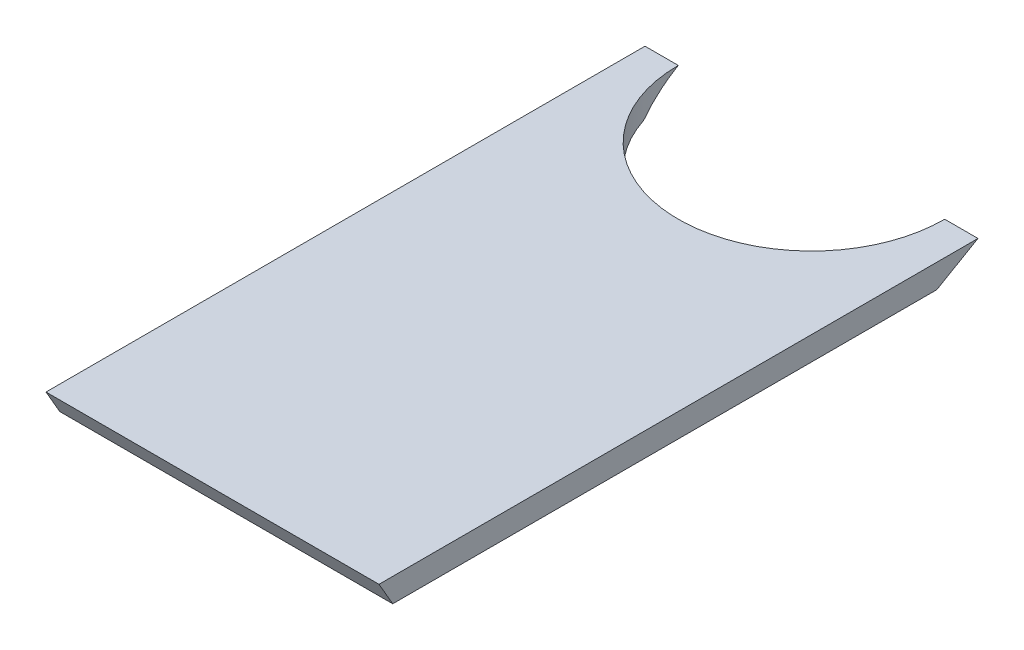
ISO-10303-21;
HEADER;
FILE_DESCRIPTION(('STEP AP214'),'2;1');
FILE_NAME('part.step','',(''),(''),'','','');
FILE_SCHEMA(('AUTOMOTIVE_DESIGN { 1 0 10303 214 1 1 1 1 }'));
ENDSEC;
DATA;
#1=APPLICATION_CONTEXT('core data for automotive mechanical design processes');
#2=APPLICATION_PROTOCOL_DEFINITION('international standard','automotive_design',2000,#1);
#3=PRODUCT_CONTEXT('',#1,'mechanical');
#4=PRODUCT('Part','Part','',(#3));
#5=PRODUCT_RELATED_PRODUCT_CATEGORY('part','',(#4));
#6=PRODUCT_DEFINITION_FORMATION('','',#4);
#7=PRODUCT_DEFINITION_CONTEXT('part definition',#1,'design');
#8=PRODUCT_DEFINITION('design','',#6,#7);
#9=PRODUCT_DEFINITION_SHAPE('','',#8);
#10=(LENGTH_UNIT() NAMED_UNIT(*) SI_UNIT(.MILLI.,.METRE.));
#11=(NAMED_UNIT(*) PLANE_ANGLE_UNIT() SI_UNIT($,.RADIAN.));
#12=(NAMED_UNIT(*) SI_UNIT($,.STERADIAN.) SOLID_ANGLE_UNIT());
#13=UNCERTAINTY_MEASURE_WITH_UNIT(LENGTH_MEASURE(1.E-05),#10,'distance_accuracy_value','');
#14=(GEOMETRIC_REPRESENTATION_CONTEXT(3) GLOBAL_UNCERTAINTY_ASSIGNED_CONTEXT((#13)) GLOBAL_UNIT_ASSIGNED_CONTEXT((#10,
#11,#12)) REPRESENTATION_CONTEXT('',''));
#15=CARTESIAN_POINT('',(0.,0.,0.));
#16=DIRECTION('',(0.,0.,1.));
#17=DIRECTION('',(1.,0.,0.));
#18=AXIS2_PLACEMENT_3D('',#15,#16,#17);
#19=CARTESIAN_POINT('',(44.45,-28.3981155746347,-16.395659671494));
#20=DIRECTION('',(0.,-0.866025403784432,-0.500000000000012));
#21=DIRECTION('',(0.,0.500000000000012,-0.866025403784432));
#22=AXIS2_PLACEMENT_3D('',#19,#20,#21);
#23=PLANE('',#22);
#24=DIRECTION('',(-1.,0.,0.));
#25=VECTOR('',#24,1.);
#26=CARTESIAN_POINT('',(44.45,3.17499999999927,-71.0819000000025));
#27=LINE('',#26,#25);
#28=CARTESIAN_POINT('',(-35.56,3.17499999999927,-71.0819000000025));
#29=VERTEX_POINT('',#28);
#30=CARTESIAN_POINT('',(-44.45,3.17499999999927,-71.0819000000025));
#31=VERTEX_POINT('',#30);
#32=EDGE_CURVE('E108',#29,#31,#27,.T.);
#33=ORIENTED_EDGE('',*,*,#32,.F.);
#34=CARTESIAN_POINT('',(0.,3.17499999999927,-71.0819000000025));
#35=DIRECTION('',(0.,-0.866025403784432,-0.500000000000012));
#36=DIRECTION('',(0.,0.500000000000012,-0.866025403784432));
#37=AXIS2_PLACEMENT_3D('',#34,#35,#36);
#38=ELLIPSE('',#37,41.0611511447665,35.56);
#39=CARTESIAN_POINT('',(-33.8163584674641,-3.17500000000075,-60.0833773719417));
#40=VERTEX_POINT('',#39);
#41=EDGE_CURVE('E96',#29,#40,#38,.F.);
#42=ORIENTED_EDGE('',*,*,#41,.T.);
#43=DIRECTION('',(-1.,0.,0.));
#44=VECTOR('',#43,1.);
#45=CARTESIAN_POINT('',(44.45,-3.17500000000003,-60.0833773719417));
#46=LINE('',#45,#44);
#47=CARTESIAN_POINT('',(-44.45,-3.17500000000003,-60.0833773719417));
#48=VERTEX_POINT('',#47);
#49=EDGE_CURVE('E79',#40,#48,#46,.T.);
#50=ORIENTED_EDGE('',*,*,#49,.T.);
#51=DIRECTION('',(0.,-0.500000000000012,0.866025403784432));
#52=VECTOR('',#51,1.);
#53=CARTESIAN_POINT('',(-44.45,-28.3981155746347,-16.395659671494));
#54=LINE('',#53,#52);
#55=EDGE_CURVE('E124',#31,#48,#54,.T.);
#56=ORIENTED_EDGE('',*,*,#55,.F.);
#57=EDGE_LOOP('',(#33,#42,#50,#56));
#58=FACE_BOUND('',#57,.T.);
#59=ADVANCED_FACE('F35',(#58),#23,.T.);
#60=CARTESIAN_POINT('',(44.45,-3.17500000000003,-60.0833773719417));
#61=VERTEX_POINT('',#60);
#62=CARTESIAN_POINT('',(33.8163584674641,-3.17500000000003,-60.0833773719417));
#63=VERTEX_POINT('',#62);
#64=EDGE_CURVE('E102',#61,#63,#46,.T.);
#65=ORIENTED_EDGE('',*,*,#64,.T.);
#66=CARTESIAN_POINT('',(35.56,3.17499999999927,-71.0819000000025));
#67=VERTEX_POINT('',#66);
#68=EDGE_CURVE('E48',#63,#67,#38,.F.);
#69=ORIENTED_EDGE('',*,*,#68,.T.);
#70=CARTESIAN_POINT('',(44.45,3.17499999999927,-71.0819000000025));
#71=VERTEX_POINT('',#70);
#72=EDGE_CURVE('E42',#71,#67,#27,.T.);
#73=ORIENTED_EDGE('',*,*,#72,.F.);
#74=DIRECTION('',(0.,-0.500000000000012,0.866025403784432));
#75=VECTOR('',#74,1.);
#76=CARTESIAN_POINT('',(44.45,-28.3981155746347,-16.395659671494));
#77=LINE('',#76,#75);
#78=EDGE_CURVE('E118',#71,#61,#77,.T.);
#79=ORIENTED_EDGE('',*,*,#78,.T.);
#80=EDGE_LOOP('',(#65,#69,#73,#79));
#81=FACE_BOUND('',#80,.T.);
#82=ADVANCED_FACE('F101',(#81),#23,.T.);
#83=CARTESIAN_POINT('',(44.45,3.17499999999927,0.));
#84=DIRECTION('',(0.,1.,0.));
#85=DIRECTION('',(0.,0.,1.));
#86=AXIS2_PLACEMENT_3D('',#83,#84,#85);
#87=PLANE('',#86);
#88=ORIENTED_EDGE('',*,*,#72,.T.);
#89=CARTESIAN_POINT('',(0.,3.17499999999927,-71.0819000000025));
#90=DIRECTION('',(0.,1.,0.));
#91=DIRECTION('',(0.,0.,1.));
#92=AXIS2_PLACEMENT_3D('',#89,#90,#91);
#93=CIRCLE('',#92,35.56);
#94=EDGE_CURVE('E94',#67,#29,#93,.F.);
#95=ORIENTED_EDGE('',*,*,#94,.T.);
#96=ORIENTED_EDGE('',*,*,#32,.T.);
#97=DIRECTION('',(0.,0.,-1.));
#98=VECTOR('',#97,1.);
#99=CARTESIAN_POINT('',(-44.45,3.17499999999927,0.));
#100=LINE('',#99,#98);
#101=CARTESIAN_POINT('',(-44.45,3.17499999999927,88.8254705950004));
#102=VERTEX_POINT('',#101);
#103=EDGE_CURVE('E121',#102,#31,#100,.T.);
#104=ORIENTED_EDGE('',*,*,#103,.F.);
#105=DIRECTION('',(-1.,0.,0.));
#106=VECTOR('',#105,1.);
#107=CARTESIAN_POINT('',(44.45,3.17499999999927,88.8254705950004));
#108=LINE('',#107,#106);
#109=CARTESIAN_POINT('',(44.45,3.17499999999927,88.8254705950004));
#110=VERTEX_POINT('',#109);
#111=EDGE_CURVE('E109',#110,#102,#108,.T.);
#112=ORIENTED_EDGE('',*,*,#111,.F.);
#113=DIRECTION('',(0.,0.,-1.));
#114=VECTOR('',#113,1.);
#115=CARTESIAN_POINT('',(44.45,3.17499999999927,0.));
#116=LINE('',#115,#114);
#117=EDGE_CURVE('E107',#110,#71,#116,.T.);
#118=ORIENTED_EDGE('',*,*,#117,.T.);
#119=EDGE_LOOP('',(#88,#95,#96,#104,#112,#118));
#120=FACE_BOUND('',#119,.T.);
#121=ADVANCED_FACE('F105',(#120),#87,.T.);
#122=CARTESIAN_POINT('',(44.45,-3.17500000000033,0.));
#123=DIRECTION('',(0.,1.,0.));
#124=DIRECTION('',(0.,0.,1.));
#125=AXIS2_PLACEMENT_3D('',#122,#123,#124);
#126=PLANE('',#125);
#127=CARTESIAN_POINT('',(0.,-3.17499999999997,-71.0819000000025));
#128=DIRECTION('',(0.,1.,0.));
#129=DIRECTION('',(0.,0.,1.));
#130=AXIS2_PLACEMENT_3D('',#127,#128,#129);
#131=CIRCLE('',#130,35.56);
#132=EDGE_CURVE('E11',#63,#40,#131,.F.);
#133=ORIENTED_EDGE('',*,*,#132,.F.);
#134=ORIENTED_EDGE('',*,*,#64,.F.);
#135=DIRECTION('',(0.,0.,-1.));
#136=VECTOR('',#135,1.);
#137=CARTESIAN_POINT('',(44.45,-3.17500000000033,0.));
#138=LINE('',#137,#136);
#139=CARTESIAN_POINT('',(44.45,-3.17500000000075,85.1592963856463));
#140=VERTEX_POINT('',#139);
#141=EDGE_CURVE('E57',#140,#61,#138,.T.);
#142=ORIENTED_EDGE('',*,*,#141,.F.);
#143=DIRECTION('',(-1.,0.,0.));
#144=VECTOR('',#143,1.);
#145=CARTESIAN_POINT('',(44.45,-3.17500000000075,85.1592963856463));
#146=LINE('',#145,#144);
#147=CARTESIAN_POINT('',(-44.45,-3.17500000000075,85.1592963856463));
#148=VERTEX_POINT('',#147);
#149=EDGE_CURVE('E112',#140,#148,#146,.T.);
#150=ORIENTED_EDGE('',*,*,#149,.T.);
#151=DIRECTION('',(0.,0.,-1.));
#152=VECTOR('',#151,1.);
#153=CARTESIAN_POINT('',(-44.45,-3.17500000000033,0.));
#154=LINE('',#153,#152);
#155=EDGE_CURVE('E116',#148,#48,#154,.T.);
#156=ORIENTED_EDGE('',*,*,#155,.T.);
#157=ORIENTED_EDGE('',*,*,#49,.F.);
#158=EDGE_LOOP('',(#133,#134,#142,#150,#156,#157));
#159=FACE_BOUND('',#158,.T.);
#160=ADVANCED_FACE('F139',(#159),#126,.F.);
#161=CARTESIAN_POINT('',(44.45,-37.6688070191892,65.2442876177428));
#162=DIRECTION('',(0.,0.5,-0.866025403784438));
#163=DIRECTION('',(0.,0.866025403784439,0.5));
#164=AXIS2_PLACEMENT_3D('',#161,#162,#163);
#165=PLANE('',#164);
#166=DIRECTION('',(0.,-0.866025403784438,-0.5));
#167=VECTOR('',#166,1.);
#168=CARTESIAN_POINT('',(-44.45,-37.6688070191892,65.2442876177428));
#169=LINE('',#168,#167);
#170=EDGE_CURVE('E119',#102,#148,#169,.T.);
#171=ORIENTED_EDGE('',*,*,#170,.T.);
#172=ORIENTED_EDGE('',*,*,#149,.F.);
#173=DIRECTION('',(0.,-0.866025403784438,-0.5));
#174=VECTOR('',#173,1.);
#175=CARTESIAN_POINT('',(44.45,-37.6688070191892,65.2442876177428));
#176=LINE('',#175,#174);
#177=EDGE_CURVE('E128',#110,#140,#176,.T.);
#178=ORIENTED_EDGE('',*,*,#177,.F.);
#179=ORIENTED_EDGE('',*,*,#111,.T.);
#180=EDGE_LOOP('',(#171,#172,#178,#179));
#181=FACE_BOUND('',#180,.T.);
#182=ADVANCED_FACE('F135',(#181),#165,.F.);
#183=CARTESIAN_POINT('',(44.45,0.,0.));
#184=DIRECTION('',(1.,0.,0.));
#185=DIRECTION('',(0.,0.,-1.));
#186=AXIS2_PLACEMENT_3D('',#183,#184,#185);
#187=PLANE('',#186);
#188=ORIENTED_EDGE('',*,*,#78,.F.);
#189=ORIENTED_EDGE('',*,*,#117,.F.);
#190=ORIENTED_EDGE('',*,*,#177,.T.);
#191=ORIENTED_EDGE('',*,*,#141,.T.);
#192=EDGE_LOOP('',(#188,#189,#190,#191));
#193=FACE_BOUND('',#192,.T.);
#194=ADVANCED_FACE('F131',(#193),#187,.T.);
#195=CARTESIAN_POINT('',(-44.45,0.,0.));
#196=DIRECTION('',(1.,0.,0.));
#197=DIRECTION('',(0.,0.,-1.));
#198=AXIS2_PLACEMENT_3D('',#195,#196,#197);
#199=PLANE('',#198);
#200=ORIENTED_EDGE('',*,*,#55,.T.);
#201=ORIENTED_EDGE('',*,*,#155,.F.);
#202=ORIENTED_EDGE('',*,*,#170,.F.);
#203=ORIENTED_EDGE('',*,*,#103,.T.);
#204=EDGE_LOOP('',(#200,#201,#202,#203));
#205=FACE_BOUND('',#204,.T.);
#206=ADVANCED_FACE('F142',(#205),#199,.F.);
#207=CARTESIAN_POINT('',(0.,-3.17500000000075,-71.0819000000025));
#208=DIRECTION('',(0.,1.,0.));
#209=DIRECTION('',(0.,0.,1.));
#210=AXIS2_PLACEMENT_3D('',#207,#208,#209);
#211=CYLINDRICAL_SURFACE('',#210,35.56);
#212=ORIENTED_EDGE('',*,*,#94,.F.);
#213=ORIENTED_EDGE('',*,*,#68,.F.);
#214=ORIENTED_EDGE('',*,*,#132,.T.);
#215=ORIENTED_EDGE('',*,*,#41,.F.);
#216=EDGE_LOOP('',(#212,#213,#214,#215));
#217=FACE_BOUND('',#216,.T.);
#218=ADVANCED_FACE('F95',(#217),#211,.F.);
#219=CLOSED_SHELL('',(#59,#82,#121,#160,#182,#194,#206,#218));
#220=MANIFOLD_SOLID_BREP('B2',#219);
#221=ADVANCED_BREP_SHAPE_REPRESENTATION('',(#18,#220),#14);
#222=SHAPE_DEFINITION_REPRESENTATION(#9,#221);
ENDSEC;
END-ISO-10303-21;
